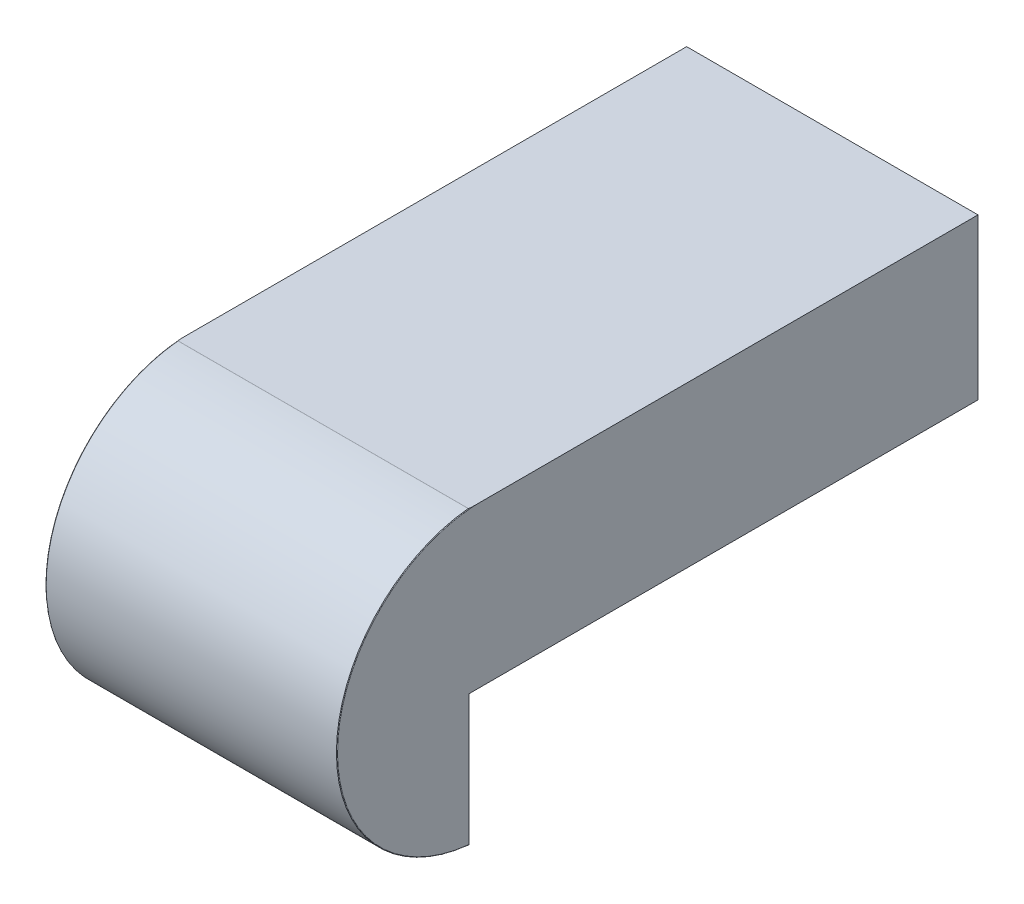
ISO-10303-21;
HEADER;
FILE_DESCRIPTION(('STEP AP214'),'2;1');
FILE_NAME('part.step','',(''),(''),'','','');
FILE_SCHEMA(('AUTOMOTIVE_DESIGN { 1 0 10303 214 1 1 1 1 }'));
ENDSEC;
DATA;
#1=APPLICATION_CONTEXT('core data for automotive mechanical design processes');
#2=APPLICATION_PROTOCOL_DEFINITION('international standard','automotive_design',2000,#1);
#3=PRODUCT_CONTEXT('',#1,'mechanical');
#4=PRODUCT('Part','Part','',(#3));
#5=PRODUCT_RELATED_PRODUCT_CATEGORY('part','',(#4));
#6=PRODUCT_DEFINITION_FORMATION('','',#4);
#7=PRODUCT_DEFINITION_CONTEXT('part definition',#1,'design');
#8=PRODUCT_DEFINITION('design','',#6,#7);
#9=PRODUCT_DEFINITION_SHAPE('','',#8);
#10=(LENGTH_UNIT() NAMED_UNIT(*) SI_UNIT(.MILLI.,.METRE.));
#11=(NAMED_UNIT(*) PLANE_ANGLE_UNIT() SI_UNIT($,.RADIAN.));
#12=(NAMED_UNIT(*) SI_UNIT($,.STERADIAN.) SOLID_ANGLE_UNIT());
#13=UNCERTAINTY_MEASURE_WITH_UNIT(LENGTH_MEASURE(1.E-05),#10,'distance_accuracy_value','');
#14=(GEOMETRIC_REPRESENTATION_CONTEXT(3) GLOBAL_UNCERTAINTY_ASSIGNED_CONTEXT((#13)) GLOBAL_UNIT_ASSIGNED_CONTEXT((#10,
#11,#12)) REPRESENTATION_CONTEXT('',''));
#15=CARTESIAN_POINT('',(0.,0.,0.));
#16=DIRECTION('',(0.,0.,1.));
#17=DIRECTION('',(1.,0.,0.));
#18=AXIS2_PLACEMENT_3D('',#15,#16,#17);
#19=CARTESIAN_POINT('',(100.,0.,0.));
#20=DIRECTION('',(0.,1.,0.));
#21=DIRECTION('',(0.,0.,1.));
#22=AXIS2_PLACEMENT_3D('',#19,#20,#21);
#23=PLANE('',#22);
#24=DIRECTION('',(0.,0.,-1.));
#25=VECTOR('',#24,1.);
#26=CARTESIAN_POINT('',(0.,0.,0.));
#27=LINE('',#26,#25);
#28=CARTESIAN_POINT('',(0.,0.,0.));
#29=VERTEX_POINT('',#28);
#30=CARTESIAN_POINT('',(0.,0.,-174.750621894396));
#31=VERTEX_POINT('',#30);
#32=EDGE_CURVE('E133',#29,#31,#27,.T.);
#33=ORIENTED_EDGE('',*,*,#32,.T.);
#34=DIRECTION('',(-1.,0.,0.));
#35=VECTOR('',#34,1.);
#36=CARTESIAN_POINT('',(100.,0.,-174.750621894396));
#37=LINE('',#36,#35);
#38=CARTESIAN_POINT('',(100.,0.,-174.750621894396));
#39=VERTEX_POINT('',#38);
#40=EDGE_CURVE('E113',#39,#31,#37,.T.);
#41=ORIENTED_EDGE('',*,*,#40,.F.);
#42=DIRECTION('',(0.,0.,-1.));
#43=VECTOR('',#42,1.);
#44=CARTESIAN_POINT('',(100.,0.,0.));
#45=LINE('',#44,#43);
#46=CARTESIAN_POINT('',(100.,0.,0.));
#47=VERTEX_POINT('',#46);
#48=EDGE_CURVE('E120',#47,#39,#45,.T.);
#49=ORIENTED_EDGE('',*,*,#48,.F.);
#50=DIRECTION('',(-1.,0.,0.));
#51=VECTOR('',#50,1.);
#52=CARTESIAN_POINT('',(100.,0.,0.));
#53=LINE('',#52,#51);
#54=EDGE_CURVE('E208',#47,#29,#53,.T.);
#55=ORIENTED_EDGE('',*,*,#54,.T.);
#56=EDGE_LOOP('',(#33,#41,#49,#55));
#57=FACE_BOUND('',#56,.T.);
#58=ADVANCED_FACE('F37',(#57),#23,.F.);
#59=CARTESIAN_POINT('',(100.,0.,-174.750621894396));
#60=DIRECTION('',(0.,0.,1.));
#61=DIRECTION('',(1.,0.,0.));
#62=AXIS2_PLACEMENT_3D('',#59,#60,#61);
#63=PLANE('',#62);
#64=DIRECTION('',(0.,1.,0.));
#65=VECTOR('',#64,1.);
#66=CARTESIAN_POINT('',(0.,0.,-174.750621894396));
#67=LINE('',#66,#65);
#68=CARTESIAN_POINT('',(0.,55.,-174.750621894396));
#69=VERTEX_POINT('',#68);
#70=EDGE_CURVE('E199',#31,#69,#67,.T.);
#71=ORIENTED_EDGE('',*,*,#70,.T.);
#72=DIRECTION('',(-1.,0.,0.));
#73=VECTOR('',#72,1.);
#74=CARTESIAN_POINT('',(100.,55.,-174.750621894396));
#75=LINE('',#74,#73);
#76=CARTESIAN_POINT('',(100.,55.,-174.750621894396));
#77=VERTEX_POINT('',#76);
#78=EDGE_CURVE('E116',#77,#69,#75,.T.);
#79=ORIENTED_EDGE('',*,*,#78,.F.);
#80=DIRECTION('',(0.,1.,0.));
#81=VECTOR('',#80,1.);
#82=CARTESIAN_POINT('',(100.,0.,-174.750621894396));
#83=LINE('',#82,#81);
#84=EDGE_CURVE('E108',#39,#77,#83,.T.);
#85=ORIENTED_EDGE('',*,*,#84,.F.);
#86=ORIENTED_EDGE('',*,*,#40,.T.);
#87=EDGE_LOOP('',(#71,#79,#85,#86));
#88=FACE_BOUND('',#87,.T.);
#89=ADVANCED_FACE('F111',(#88),#63,.F.);
#90=CARTESIAN_POINT('',(100.,55.,0.));
#91=DIRECTION('',(0.,1.,0.));
#92=DIRECTION('',(0.,0.,1.));
#93=AXIS2_PLACEMENT_3D('',#90,#91,#92);
#94=PLANE('',#93);
#95=DIRECTION('',(1.,0.,0.));
#96=VECTOR('',#95,1.);
#97=CARTESIAN_POINT('',(100.,55.,-0.00992200086264491));
#98=LINE('',#97,#96);
#99=CARTESIAN_POINT('',(0.1789622828441,55.,-0.00992200086264491));
#100=VERTEX_POINT('',#99);
#101=CARTESIAN_POINT('',(99.8210377171559,55.,-0.00992200086264491));
#102=VERTEX_POINT('',#101);
#103=EDGE_CURVE('E58',#100,#102,#98,.T.);
#104=ORIENTED_EDGE('',*,*,#103,.T.);
#105=CARTESIAN_POINT('',(99.8210377171559,55.,-0.00992200086264491));
#106=CARTESIAN_POINT('',(99.8242856851728,55.,-0.0132737130348301));
#107=CARTESIAN_POINT('',(99.8271699047708,55.,-0.0169113153091457));
#108=CARTESIAN_POINT('',(99.8323970847614,55.,-0.0245227123870038));
#109=CARTESIAN_POINT('',(99.8347440593362,55.,-0.0284936890193018));
#110=CARTESIAN_POINT('',(99.841272000731,55.,-0.0405593705385063));
#111=CARTESIAN_POINT('',(99.8449992929228,55.,-0.0488856336037728));
#112=CARTESIAN_POINT('',(99.8550182861489,55.,-0.0737309962479569));
#113=CARTESIAN_POINT('',(99.8604240335902,55.,-0.0905891325204903));
#114=CARTESIAN_POINT('',(99.8701322844046,55.,-0.124608004146012));
#115=CARTESIAN_POINT('',(99.8744336526384,55.,-0.141769031623057));
#116=CARTESIAN_POINT('',(99.8824075533707,55.,-0.176593217011301));
#117=CARTESIAN_POINT('',(99.8860660348369,55.,-0.194259608251956));
#118=CARTESIAN_POINT('',(99.8928780570204,55.,-0.229671967471304));
#119=CARTESIAN_POINT('',(99.8960319920911,55.,-0.247417862046448));
#120=CARTESIAN_POINT('',(99.9048675144361,55.,-0.300325110340975));
#121=CARTESIAN_POINT('',(99.910010975835,55.,-0.335576071399748));
#122=CARTESIAN_POINT('',(99.9193707979899,55.,-0.406202332302938));
#123=CARTESIAN_POINT('',(99.9235869753482,55.,-0.441577655340527));
#124=CARTESIAN_POINT('',(99.9352447915441,55.,-0.547867790366124));
#125=CARTESIAN_POINT('',(99.9416875457875,55.,-0.618891511196469));
#126=CARTESIAN_POINT('',(99.9528699209462,55.,-0.760146510094796));
#127=CARTESIAN_POINT('',(99.9576303364173,55.,-0.830376261460992));
#128=CARTESIAN_POINT('',(99.9660047334712,55.,-0.970872353730498));
#129=CARTESIAN_POINT('',(99.9696192188429,55.,-1.04113866491385));
#130=CARTESIAN_POINT('',(99.9789422050143,55.,-1.24657731989452));
#131=CARTESIAN_POINT('',(99.9835045153802,55.,-1.38180052804802));
#132=CARTESIAN_POINT('',(99.990629898809,55.,-1.65232960497381));
#133=CARTESIAN_POINT('',(99.9931924373155,55.,-1.78763548617882));
#134=CARTESIAN_POINT('',(99.9969986842383,55.,-2.06065696098478));
#135=CARTESIAN_POINT('',(99.9982182750839,55.,-2.19837286465282));
#136=CARTESIAN_POINT('',(99.9997079511522,55.,-2.47375479965934));
#137=CARTESIAN_POINT('',(99.9999784189926,55.,-2.61142082871942));
#138=CARTESIAN_POINT('',(100.,55.,-2.74908351302104));
#139=B_SPLINE_CURVE_WITH_KNOTS('',3,(#105,#106,#107,#108,#109,#110,#111,#112,#113,#114,#115,
#116,#117,#118,#119,#120,#121,#122,#123,#124,#125,#126,#127,#128,#129,#130,#131,#132,#133,#134,
#135,#136,#137,#138),.UNSPECIFIED.,.F.,.F.,(4,2,2,2,2,2,2,2,2,2,2,2,2,2,2,2,4),(0.,
0.0139110663108244,0.027714527565178,0.0550301595069425,0.108041303463521,0.161106718894535,
0.21521710091673,0.269284981413721,0.376134309334084,0.483004750903661,0.696913082850102,
0.908076429824084,1.11914681324587,1.52502048848577,1.93100262018266,2.34416241526593,
2.75715563509226),.UNSPECIFIED.);
#140=CARTESIAN_POINT('',(100.,55.,-2.74908351302104));
#141=VERTEX_POINT('',#140);
#142=EDGE_CURVE('E50',#102,#141,#139,.T.);
#143=ORIENTED_EDGE('',*,*,#142,.T.);
#144=DIRECTION('',(0.,0.,-1.));
#145=VECTOR('',#144,1.);
#146=CARTESIAN_POINT('',(100.,55.,0.));
#147=LINE('',#146,#145);
#148=EDGE_CURVE('E119',#141,#77,#147,.T.);
#149=ORIENTED_EDGE('',*,*,#148,.T.);
#150=ORIENTED_EDGE('',*,*,#78,.T.);
#151=DIRECTION('',(0.,0.,-1.));
#152=VECTOR('',#151,1.);
#153=CARTESIAN_POINT('',(0.,55.,0.));
#154=LINE('',#153,#152);
#155=CARTESIAN_POINT('',(0.,55.,-2.74908351301642));
#156=VERTEX_POINT('',#155);
#157=EDGE_CURVE('E201',#156,#69,#154,.T.);
#158=ORIENTED_EDGE('',*,*,#157,.F.);
#159=CARTESIAN_POINT('',(0.,55.0000000000001,-2.74908351301642));
#160=CARTESIAN_POINT('',(4.52715035784556E-07,55.,-2.68285054194414));
#161=CARTESIAN_POINT('',(6.68258140727781E-05,55.,-2.61661758748611));
#162=CARTESIAN_POINT('',(0.000371445146520239,55.,-2.48412579421662));
#163=CARTESIAN_POINT('',(0.000609759608998665,55.,-2.41786695556891));
#164=CARTESIAN_POINT('',(0.00164299665843514,55.,-2.21902606976989));
#165=CARTESIAN_POINT('',(0.00275629180797154,55.,-2.08644521247229));
#166=CARTESIAN_POINT('',(0.0062482319497455,55.,-1.82129113527878));
#167=CARTESIAN_POINT('',(0.00862695555811384,55.,-1.68871791636922));
#168=CARTESIAN_POINT('',(0.0152306321246558,55.,-1.42368170066099));
#169=CARTESIAN_POINT('',(0.0194546115115631,55.,-1.29121868259385));
#170=CARTESIAN_POINT('',(0.0279318996475331,55.,-1.0926220400949));
#171=CARTESIAN_POINT('',(0.0311143193828787,55.,-1.02644304177515));
#172=CARTESIAN_POINT('',(0.0384074321085407,55.,-0.89413692178655));
#173=CARTESIAN_POINT('',(0.0425180878607019,55.,-0.828009798143396));
#174=CARTESIAN_POINT('',(0.0518582670409698,55.,-0.697828619388571));
#175=CARTESIAN_POINT('',(0.0570505200930727,55.,-0.633771893231005));
#176=CARTESIAN_POINT('',(0.0691280088531423,55.,-0.505766302299961));
#177=CARTESIAN_POINT('',(0.0760142367015542,55.,-0.441817522929216));
#178=CARTESIAN_POINT('',(0.088827465461439,55.,-0.343985077282696));
#179=CARTESIAN_POINT('',(0.0937086245310054,55.,-0.309964170085007));
#180=CARTESIAN_POINT('',(0.104708989133214,55.,-0.242165051493941));
#181=CARTESIAN_POINT('',(0.110826025043358,55.,-0.208386520747844));
#182=CARTESIAN_POINT('',(0.121879093594456,55.,-0.157387928791595));
#183=CARTESIAN_POINT('',(0.125978010471646,55.,-0.139984236003566));
#184=CARTESIAN_POINT('',(0.135134057417282,55.,-0.105433972986083));
#185=CARTESIAN_POINT('',(0.140189317046875,55.,-0.0882869702029399));
#186=CARTESIAN_POINT('',(0.149287464077541,55.,-0.0629682054494354));
#187=CARTESIAN_POINT('',(0.152606101601091,55.,-0.0545285883330807));
#188=CARTESIAN_POINT('',(0.159999696012576,55.,-0.0380169137484504));
#189=CARTESIAN_POINT('',(0.164066837666627,55.,-0.0299420440183101));
#190=CARTESIAN_POINT('',(0.171991199108946,55.,-0.0180442211750724));
#191=CARTESIAN_POINT('',(0.175263199245129,55.,-0.0138260463966446));
#192=CARTESIAN_POINT('',(0.178962282844117,55.,-0.00992200086265542));
#193=B_SPLINE_CURVE_WITH_KNOTS('',3,(#159,#160,#161,#162,#163,#164,#165,#166,#167,#168,#169,
#170,#171,#172,#173,#174,#175,#176,#177,#178,#179,#180,#181,#182,#183,#184,#185,#186,#187,#188,
#189,#190,#191,#192),.UNSPECIFIED.,.F.,.F.,(4,2,2,2,2,2,2,2,2,2,2,2,2,2,2,2,4),(0.,
0.198698794632167,0.397476479502522,0.795228526000218,1.19300528616631,1.59057242922016,
1.78933455128834,1.98808870100886,2.1808795340589,2.37378355232436,2.4768842558798,
2.57980551135147,2.63344250064185,2.68697565009863,2.71418886515481,2.74113258951674,
2.75713684320104),.UNSPECIFIED.);
#194=EDGE_CURVE('E63',#156,#100,#193,.T.);
#195=ORIENTED_EDGE('',*,*,#194,.T.);
#196=EDGE_LOOP('',(#104,#143,#149,#150,#158,#195));
#197=FACE_BOUND('',#196,.T.);
#198=ADVANCED_FACE('F165',(#197),#94,.T.);
#199=CARTESIAN_POINT('',(100.,5.,-5.));
#200=DIRECTION('',(-1.,0.,0.));
#201=DIRECTION('',(0.,0.,1.));
#202=AXIS2_PLACEMENT_3D('',#199,#200,#201);
#203=CYLINDRICAL_SURFACE('',#202,50.2493781056044);
#204=DIRECTION('',(-1.,0.,0.));
#205=VECTOR('',#204,1.);
#206=CARTESIAN_POINT('',(100.,-45.,0.));
#207=LINE('',#206,#205);
#208=CARTESIAN_POINT('',(99.8012625,-45.,0.));
#209=VERTEX_POINT('',#208);
#210=CARTESIAN_POINT('',(0.198737500000004,-45.,0.));
#211=VERTEX_POINT('',#210);
#212=EDGE_CURVE('E138',#209,#211,#207,.T.);
#213=ORIENTED_EDGE('',*,*,#212,.F.);
#214=CARTESIAN_POINT('',(99.8012625,5.,-5.));
#215=DIRECTION('',(1.,0.,0.));
#216=DIRECTION('',(0.,0.,-1.));
#217=AXIS2_PLACEMENT_3D('',#214,#215,#216);
#218=CIRCLE('',#217,50.2493781056044);
#219=CARTESIAN_POINT('',(99.8012625,54.9990097872742,0.00989224355768536));
#220=VERTEX_POINT('',#219);
#221=EDGE_CURVE('E219',#209,#220,#218,.F.);
#222=ORIENTED_EDGE('',*,*,#221,.T.);
#223=DIRECTION('',(-1.,0.,0.));
#224=VECTOR('',#223,1.);
#225=CARTESIAN_POINT('',(100.,54.9990097872742,0.00989224355768537));
#226=LINE('',#225,#224);
#227=CARTESIAN_POINT('',(0.198737500000004,54.9990097872742,0.00989224355768536));
#228=VERTEX_POINT('',#227);
#229=EDGE_CURVE('E220',#220,#228,#226,.T.);
#230=ORIENTED_EDGE('',*,*,#229,.T.);
#231=CARTESIAN_POINT('',(0.198737500000004,5.,-5.));
#232=DIRECTION('',(1.,0.,0.));
#233=DIRECTION('',(0.,0.,-1.));
#234=AXIS2_PLACEMENT_3D('',#231,#232,#233);
#235=CIRCLE('',#234,50.2493781056044);
#236=EDGE_CURVE('E216',#228,#211,#235,.T.);
#237=ORIENTED_EDGE('',*,*,#236,.T.);
#238=EDGE_LOOP('',(#213,#222,#230,#237));
#239=FACE_BOUND('',#238,.T.);
#240=ADVANCED_FACE('F158',(#239),#203,.T.);
#241=CARTESIAN_POINT('',(100.,0.,0.));
#242=DIRECTION('',(0.,0.,1.));
#243=DIRECTION('',(1.,0.,0.));
#244=AXIS2_PLACEMENT_3D('',#241,#242,#243);
#245=PLANE('',#244);
#246=DIRECTION('',(0.,1.,0.));
#247=VECTOR('',#246,1.);
#248=CARTESIAN_POINT('',(100.,0.,0.));
#249=LINE('',#248,#247);
#250=CARTESIAN_POINT('',(100.,-44.8002673188747,0.));
#251=VERTEX_POINT('',#250);
#252=EDGE_CURVE('E126',#251,#47,#249,.T.);
#253=ORIENTED_EDGE('',*,*,#252,.F.);
#254=CARTESIAN_POINT('',(100.,-44.8002673188747,0.));
#255=CARTESIAN_POINT('',(100.000009307257,-44.8115449737831,0.));
#256=CARTESIAN_POINT('',(99.9990501755434,-44.822820121073,0.));
#257=CARTESIAN_POINT('',(99.9952632671372,-44.8450450836002,0.));
#258=CARTESIAN_POINT('',(99.9924366835428,-44.8559951018951,0.));
#259=CARTESIAN_POINT('',(99.9849809674033,-44.8772703267576,0.));
#260=CARTESIAN_POINT('',(99.980350879446,-44.8875951987965,0.));
#261=CARTESIAN_POINT('',(99.969420715045,-44.9073166807088,0.));
#262=CARTESIAN_POINT('',(99.963121001304,-44.9167134915826,0.));
#263=CARTESIAN_POINT('',(99.9490428560238,-44.9342900609886,0.));
#264=CARTESIAN_POINT('',(99.941267822926,-44.9424725410466,0.));
#265=CARTESIAN_POINT('',(99.9244466795364,-44.957410203187,0.));
#266=CARTESIAN_POINT('',(99.9154003332803,-44.96416511972,0.));
#267=CARTESIAN_POINT('',(99.8963398324537,-44.9760205347142,0.));
#268=CARTESIAN_POINT('',(99.8863302486871,-44.9811283905795,0.));
#269=CARTESIAN_POINT('',(99.8655951846893,-44.9895797002907,0.));
#270=CARTESIAN_POINT('',(99.854870179857,-44.9929243129144,0.));
#271=CARTESIAN_POINT('',(99.8369389536732,-44.996888032496,0.));
#272=CARTESIAN_POINT('',(99.8298489580577,-44.9980543216485,0.));
#273=CARTESIAN_POINT('',(99.8155945038251,-44.9996101739646,0.));
#274=CARTESIAN_POINT('',(99.8084301657565,-45.0000008419348,0.));
#275=CARTESIAN_POINT('',(99.8012625000002,-45.0000000000007,0.));
#276=B_SPLINE_CURVE_WITH_KNOTS('',3,(#254,#255,#256,#257,#258,#259,#260,#261,#262,#263,#264,
#265,#266,#267,#268,#269,#270,#271,#272,#273,#274,#275),.UNSPECIFIED.,.F.,.F.,(4,2,2,2,2,2,2,2,
2,2,4),(0.,0.033788723741469,0.0675558810112784,0.101340950924316,0.135118687514557,
0.168819540462434,0.202526656795853,0.23608104800608,0.269613360182144,0.291129905132912,
0.312615779537553),.UNSPECIFIED.);
#277=EDGE_CURVE('E147',#251,#209,#276,.T.);
#278=ORIENTED_EDGE('',*,*,#277,.T.);
#279=ORIENTED_EDGE('',*,*,#212,.T.);
#280=CARTESIAN_POINT('',(0.198737500000004,-45.,0.));
#281=CARTESIAN_POINT('',(0.187597099391667,-45.0000097276446,0.));
#282=CARTESIAN_POINT('',(0.176459864751561,-44.9990591926435,0.));
#283=CARTESIAN_POINT('',(0.154511131938967,-44.9953097717795,0.));
#284=CARTESIAN_POINT('',(0.143699341743519,-44.9925125979463,0.));
#285=CARTESIAN_POINT('',(0.122694594682656,-44.9851402375919,0.));
#286=CARTESIAN_POINT('',(0.112501907158891,-44.9805642835256,0.));
#287=CARTESIAN_POINT('',(0.0930284680104379,-44.9697710632288,0.));
#288=CARTESIAN_POINT('',(0.0837475921626575,-44.9635540210032,0.));
#289=CARTESIAN_POINT('',(0.0663365446061473,-44.9496413024392,0.));
#290=CARTESIAN_POINT('',(0.0582089199275454,-44.9419424390626,0.));
#291=CARTESIAN_POINT('',(0.0433526349573837,-44.9252935091881,0.));
#292=CARTESIAN_POINT('',(0.0366242609529817,-44.9163431872665,0.));
#293=CARTESIAN_POINT('',(0.0247246848206916,-44.8974011112514,0.));
#294=CARTESIAN_POINT('',(0.019561242902635,-44.8874044875398,0.));
#295=CARTESIAN_POINT('',(0.0109798225437735,-44.8666906796699,0.));
#296=CARTESIAN_POINT('',(0.00756094524309177,-44.8559738698041,0.));
#297=CARTESIAN_POINT('',(0.00337874136747136,-44.8377088490172,0.));
#298=CARTESIAN_POINT('',(0.00211247754591898,-44.8302718156448,0.));
#299=CARTESIAN_POINT('',(0.000423190113154835,-44.8153132895445,0.));
#300=CARTESIAN_POINT('',(-1.02621352671015E-06,-44.8077919314769,0.));
#301=CARTESIAN_POINT('',(-1.18845030827284E-12,-44.800267318875,0.));
#302=B_SPLINE_CURVE_WITH_KNOTS('',3,(#280,#281,#282,#283,#284,#285,#286,#287,#288,#289,#290,
#291,#292,#293,#294,#295,#296,#297,#298,#299,#300,#301),.UNSPECIFIED.,.F.,.F.,(4,2,2,2,2,2,2,2,
2,2,4),(0.,0.0333761242710096,0.0667213487155862,0.100080977655504,0.133436055436799,
0.166863690153576,0.200298157461487,0.233895805137204,0.267476124622358,0.290063697343041,
0.312619253072958),.UNSPECIFIED.);
#303=CARTESIAN_POINT('',(0.,-44.8002673188747,0.));
#304=VERTEX_POINT('',#303);
#305=EDGE_CURVE('E136',#211,#304,#302,.T.);
#306=ORIENTED_EDGE('',*,*,#305,.T.);
#307=DIRECTION('',(0.,1.,0.));
#308=VECTOR('',#307,1.);
#309=CARTESIAN_POINT('',(0.,0.,0.));
#310=LINE('',#309,#308);
#311=EDGE_CURVE('E130',#304,#29,#310,.T.);
#312=ORIENTED_EDGE('',*,*,#311,.T.);
#313=ORIENTED_EDGE('',*,*,#54,.F.);
#314=EDGE_LOOP('',(#253,#278,#279,#306,#312,#313));
#315=FACE_BOUND('',#314,.T.);
#316=ADVANCED_FACE('F153',(#315),#245,.F.);
#317=CARTESIAN_POINT('',(100.,0.,0.));
#318=DIRECTION('',(1.,0.,0.));
#319=DIRECTION('',(0.,0.,-1.));
#320=AXIS2_PLACEMENT_3D('',#317,#318,#319);
#321=PLANE('',#320);
#322=ORIENTED_EDGE('',*,*,#148,.F.);
#323=CARTESIAN_POINT('',(100.,5.,-5.));
#324=DIRECTION('',(1.,0.,0.));
#325=DIRECTION('',(0.,0.,-1.));
#326=AXIS2_PLACEMENT_3D('',#323,#324,#325);
#327=CIRCLE('',#326,50.0506406056045);
#328=EDGE_CURVE('E134',#141,#251,#327,.T.);
#329=ORIENTED_EDGE('',*,*,#328,.T.);
#330=ORIENTED_EDGE('',*,*,#252,.T.);
#331=ORIENTED_EDGE('',*,*,#48,.T.);
#332=ORIENTED_EDGE('',*,*,#84,.T.);
#333=EDGE_LOOP('',(#322,#329,#330,#331,#332));
#334=FACE_BOUND('',#333,.T.);
#335=ADVANCED_FACE('F123',(#334),#321,.T.);
#336=CARTESIAN_POINT('',(0.,0.,0.));
#337=DIRECTION('',(1.,0.,0.));
#338=DIRECTION('',(0.,0.,-1.));
#339=AXIS2_PLACEMENT_3D('',#336,#337,#338);
#340=PLANE('',#339);
#341=ORIENTED_EDGE('',*,*,#311,.F.);
#342=CARTESIAN_POINT('',(0.,5.,-5.));
#343=DIRECTION('',(1.,0.,0.));
#344=DIRECTION('',(0.,0.,-1.));
#345=AXIS2_PLACEMENT_3D('',#342,#343,#344);
#346=CIRCLE('',#345,50.0506406056045);
#347=EDGE_CURVE('E11',#304,#156,#346,.F.);
#348=ORIENTED_EDGE('',*,*,#347,.T.);
#349=ORIENTED_EDGE('',*,*,#157,.T.);
#350=ORIENTED_EDGE('',*,*,#70,.F.);
#351=ORIENTED_EDGE('',*,*,#32,.F.);
#352=EDGE_LOOP('',(#341,#348,#349,#350,#351));
#353=FACE_BOUND('',#352,.T.);
#354=ADVANCED_FACE('F160',(#353),#340,.F.);
#355=CARTESIAN_POINT('',(0.198737500000004,5.,-5.));
#356=DIRECTION('',(1.,0.,0.));
#357=DIRECTION('',(0.,0.,-1.));
#358=AXIS2_PLACEMENT_3D('',#355,#356,#357);
#359=TOROIDAL_SURFACE('',#358,50.0506406056045,0.1987375);
#360=ORIENTED_EDGE('',*,*,#305,.F.);
#361=ORIENTED_EDGE('',*,*,#236,.F.);
#362=CARTESIAN_POINT('',(0.178962282844101,55.,-0.00992200086264491));
#363=CARTESIAN_POINT('',(0.184884828152369,54.9999990061646,-0.00395821591226304));
#364=CARTESIAN_POINT('',(0.190811349939007,54.999732052765,0.00198298234395218));
#365=CARTESIAN_POINT('',(0.197407015445396,54.9991393680535,0.00856542792965626));
#366=CARTESIAN_POINT('',(0.198072232710726,54.9990762505445,0.00922897781355113));
#367=CARTESIAN_POINT('',(0.198737500000004,54.9990097872742,0.00989224355768537));
#368=B_SPLINE_CURVE_WITH_KNOTS('',3,(#362,#363,#364,#365,#366,#367),.UNSPECIFIED.,.F.,.F.,(4,2,
4),(0.,0.0251879902319014,0.0280130860720568),.UNSPECIFIED.);
#369=EDGE_CURVE('E42',#100,#228,#368,.T.);
#370=ORIENTED_EDGE('',*,*,#369,.F.);
#371=ORIENTED_EDGE('',*,*,#194,.F.);
#372=ORIENTED_EDGE('',*,*,#347,.F.);
#373=EDGE_LOOP('',(#360,#361,#370,#371,#372));
#374=FACE_BOUND('',#373,.T.);
#375=ADVANCED_FACE('F39',(#374),#359,.T.);
#376=CARTESIAN_POINT('',(100.,54.8012625,-0.00992200086264491));
#377=DIRECTION('',(-1.,0.,0.));
#378=DIRECTION('',(0.,0.,1.));
#379=AXIS2_PLACEMENT_3D('',#376,#377,#378);
#380=CYLINDRICAL_SURFACE('',#379,0.1987375);
#381=ORIENTED_EDGE('',*,*,#369,.T.);
#382=ORIENTED_EDGE('',*,*,#229,.F.);
#383=CARTESIAN_POINT('',(99.8210377171559,55.,-0.00992200086264491));
#384=CARTESIAN_POINT('',(99.8151151718478,54.9999990061646,-0.00395821591210726));
#385=CARTESIAN_POINT('',(99.8091886500612,54.999732052765,0.00198298234412368));
#386=CARTESIAN_POINT('',(99.8025929845546,54.9991393680535,0.00856542792968946));
#387=CARTESIAN_POINT('',(99.8019277672893,54.9990762505445,0.00922897781356861));
#388=CARTESIAN_POINT('',(99.8012625,54.9990097872742,0.00989224355768537));
#389=B_SPLINE_CURVE_WITH_KNOTS('',3,(#383,#384,#385,#386,#387,#388),.UNSPECIFIED.,.F.,.F.,(4,2,
4),(0.,0.0251879902319022,0.0280130860720576),.UNSPECIFIED.);
#390=EDGE_CURVE('E189',#102,#220,#389,.T.);
#391=ORIENTED_EDGE('',*,*,#390,.F.);
#392=ORIENTED_EDGE('',*,*,#103,.F.);
#393=EDGE_LOOP('',(#381,#382,#391,#392));
#394=FACE_BOUND('',#393,.T.);
#395=ADVANCED_FACE('F184',(#394),#380,.T.);
#396=CARTESIAN_POINT('',(99.8012625,5.,-5.));
#397=DIRECTION('',(1.,0.,0.));
#398=DIRECTION('',(0.,0.,-1.));
#399=AXIS2_PLACEMENT_3D('',#396,#397,#398);
#400=TOROIDAL_SURFACE('',#399,50.0506406056045,0.1987375);
#401=ORIENTED_EDGE('',*,*,#390,.T.);
#402=ORIENTED_EDGE('',*,*,#221,.F.);
#403=ORIENTED_EDGE('',*,*,#277,.F.);
#404=ORIENTED_EDGE('',*,*,#328,.F.);
#405=ORIENTED_EDGE('',*,*,#142,.F.);
#406=EDGE_LOOP('',(#401,#402,#403,#404,#405));
#407=FACE_BOUND('',#406,.T.);
#408=ADVANCED_FACE('F181',(#407),#400,.T.);
#409=CLOSED_SHELL('',(#58,#89,#198,#240,#316,#335,#354,#375,#395,#408));
#410=MANIFOLD_SOLID_BREP('B2',#409);
#411=ADVANCED_BREP_SHAPE_REPRESENTATION('',(#18,#410),#14);
#412=SHAPE_DEFINITION_REPRESENTATION(#9,#411);
ENDSEC;
END-ISO-10303-21;
